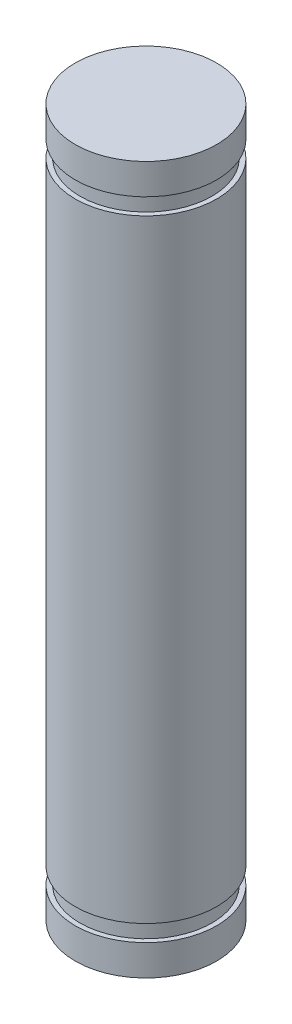
ISO-10303-21;
HEADER;
FILE_DESCRIPTION(('STEP AP214'),'2;1');
FILE_NAME('part.step','',(''),(''),'','','');
FILE_SCHEMA(('AUTOMOTIVE_DESIGN { 1 0 10303 214 1 1 1 1 }'));
ENDSEC;
DATA;
#1=APPLICATION_CONTEXT('core data for automotive mechanical design processes');
#2=APPLICATION_PROTOCOL_DEFINITION('international standard','automotive_design',2000,#1);
#3=PRODUCT_CONTEXT('',#1,'mechanical');
#4=PRODUCT('Part','Part','',(#3));
#5=PRODUCT_RELATED_PRODUCT_CATEGORY('part','',(#4));
#6=PRODUCT_DEFINITION_FORMATION('','',#4);
#7=PRODUCT_DEFINITION_CONTEXT('part definition',#1,'design');
#8=PRODUCT_DEFINITION('design','',#6,#7);
#9=PRODUCT_DEFINITION_SHAPE('','',#8);
#10=(LENGTH_UNIT() NAMED_UNIT(*) SI_UNIT(.MILLI.,.METRE.));
#11=(NAMED_UNIT(*) PLANE_ANGLE_UNIT() SI_UNIT($,.RADIAN.));
#12=(NAMED_UNIT(*) SI_UNIT($,.STERADIAN.) SOLID_ANGLE_UNIT());
#13=UNCERTAINTY_MEASURE_WITH_UNIT(LENGTH_MEASURE(1.E-05),#10,'distance_accuracy_value','');
#14=(GEOMETRIC_REPRESENTATION_CONTEXT(3) GLOBAL_UNCERTAINTY_ASSIGNED_CONTEXT((#13)) GLOBAL_UNIT_ASSIGNED_CONTEXT((#10,
#11,#12)) REPRESENTATION_CONTEXT('',''));
#15=CARTESIAN_POINT('',(0.,0.,0.));
#16=DIRECTION('',(0.,0.,1.));
#17=DIRECTION('',(1.,0.,0.));
#18=AXIS2_PLACEMENT_3D('',#15,#16,#17);
#19=CARTESIAN_POINT('',(0.,15.,0.));
#20=DIRECTION('',(0.,1.,0.));
#21=DIRECTION('',(0.,0.,1.));
#22=AXIS2_PLACEMENT_3D('',#19,#20,#21);
#23=CYLINDRICAL_SURFACE('',#22,3.);
#24=CARTESIAN_POINT('',(0.,-13.7,0.));
#25=DIRECTION('',(0.,1.,0.));
#26=DIRECTION('',(0.,0.,1.));
#27=AXIS2_PLACEMENT_3D('',#24,#25,#26);
#28=CIRCLE('',#27,3.);
#29=CARTESIAN_POINT('',(0.,-13.7,3.));
#30=VERTEX_POINT('',#29);
#31=EDGE_CURVE('E10',#30,#30,#28,.T.);
#32=ORIENTED_EDGE('',*,*,#31,.F.);
#33=EDGE_LOOP('',(#32));
#34=FACE_BOUND('',#33,.T.);
#35=CARTESIAN_POINT('',(0.,-15.,0.));
#36=DIRECTION('',(0.,1.,0.));
#37=DIRECTION('',(0.,0.,1.));
#38=AXIS2_PLACEMENT_3D('',#35,#36,#37);
#39=CIRCLE('',#38,3.);
#40=CARTESIAN_POINT('',(0.,-15.,3.));
#41=VERTEX_POINT('',#40);
#42=EDGE_CURVE('E77',#41,#41,#39,.T.);
#43=ORIENTED_EDGE('',*,*,#42,.T.);
#44=EDGE_LOOP('',(#43));
#45=FACE_BOUND('',#44,.T.);
#46=ADVANCED_FACE('F34',(#34,#45),#23,.T.);
#47=CARTESIAN_POINT('',(3.,-13.7,0.));
#48=DIRECTION('',(0.,-1.,0.));
#49=DIRECTION('',(0.,0.,-1.));
#50=AXIS2_PLACEMENT_3D('',#47,#48,#49);
#51=PLANE('',#50);
#52=CARTESIAN_POINT('',(0.,-13.7,0.));
#53=DIRECTION('',(0.,1.,0.));
#54=DIRECTION('',(0.,0.,1.));
#55=AXIS2_PLACEMENT_3D('',#52,#53,#54);
#56=CIRCLE('',#55,2.8);
#57=CARTESIAN_POINT('',(0.,-13.7,2.8));
#58=VERTEX_POINT('',#57);
#59=EDGE_CURVE('E41',#58,#58,#56,.T.);
#60=ORIENTED_EDGE('',*,*,#59,.F.);
#61=EDGE_LOOP('',(#60));
#62=FACE_BOUND('',#61,.T.);
#63=ORIENTED_EDGE('',*,*,#31,.T.);
#64=EDGE_LOOP('',(#63));
#65=FACE_BOUND('',#64,.T.);
#66=ADVANCED_FACE('F92',(#62,#65),#51,.F.);
#67=CARTESIAN_POINT('',(0.,15.,0.));
#68=DIRECTION('',(0.,1.,0.));
#69=DIRECTION('',(0.,0.,1.));
#70=AXIS2_PLACEMENT_3D('',#67,#68,#69);
#71=CYLINDRICAL_SURFACE('',#70,2.8);
#72=CARTESIAN_POINT('',(0.,-13.,0.));
#73=DIRECTION('',(0.,1.,0.));
#74=DIRECTION('',(0.,0.,1.));
#75=AXIS2_PLACEMENT_3D('',#72,#73,#74);
#76=CIRCLE('',#75,2.8);
#77=CARTESIAN_POINT('',(0.,-13.,2.8));
#78=VERTEX_POINT('',#77);
#79=EDGE_CURVE('E48',#78,#78,#76,.T.);
#80=ORIENTED_EDGE('',*,*,#79,.F.);
#81=EDGE_LOOP('',(#80));
#82=FACE_BOUND('',#81,.T.);
#83=ORIENTED_EDGE('',*,*,#59,.T.);
#84=EDGE_LOOP('',(#83));
#85=FACE_BOUND('',#84,.T.);
#86=ADVANCED_FACE('F97',(#82,#85),#71,.T.);
#87=CARTESIAN_POINT('',(2.8,-13.,0.));
#88=DIRECTION('',(0.,1.,0.));
#89=DIRECTION('',(0.,0.,1.));
#90=AXIS2_PLACEMENT_3D('',#87,#88,#89);
#91=PLANE('',#90);
#92=CARTESIAN_POINT('',(0.,-13.,0.));
#93=DIRECTION('',(0.,1.,0.));
#94=DIRECTION('',(0.,0.,1.));
#95=AXIS2_PLACEMENT_3D('',#92,#93,#94);
#96=CIRCLE('',#95,3.);
#97=CARTESIAN_POINT('',(0.,-13.,3.));
#98=VERTEX_POINT('',#97);
#99=EDGE_CURVE('E52',#98,#98,#96,.T.);
#100=ORIENTED_EDGE('',*,*,#99,.F.);
#101=EDGE_LOOP('',(#100));
#102=FACE_BOUND('',#101,.T.);
#103=ORIENTED_EDGE('',*,*,#79,.T.);
#104=EDGE_LOOP('',(#103));
#105=FACE_BOUND('',#104,.T.);
#106=ADVANCED_FACE('F102',(#102,#105),#91,.F.);
#107=CARTESIAN_POINT('',(0.,15.,0.));
#108=DIRECTION('',(0.,1.,0.));
#109=DIRECTION('',(0.,0.,1.));
#110=AXIS2_PLACEMENT_3D('',#107,#108,#109);
#111=CYLINDRICAL_SURFACE('',#110,3.);
#112=CARTESIAN_POINT('',(0.,13.,0.));
#113=DIRECTION('',(0.,1.,0.));
#114=DIRECTION('',(0.,0.,1.));
#115=AXIS2_PLACEMENT_3D('',#112,#113,#114);
#116=CIRCLE('',#115,3.);
#117=CARTESIAN_POINT('',(0.,13.,3.));
#118=VERTEX_POINT('',#117);
#119=EDGE_CURVE('E57',#118,#118,#116,.T.);
#120=ORIENTED_EDGE('',*,*,#119,.F.);
#121=EDGE_LOOP('',(#120));
#122=FACE_BOUND('',#121,.T.);
#123=ORIENTED_EDGE('',*,*,#99,.T.);
#124=EDGE_LOOP('',(#123));
#125=FACE_BOUND('',#124,.T.);
#126=ADVANCED_FACE('F108',(#122,#125),#111,.T.);
#127=CARTESIAN_POINT('',(3.,13.,0.));
#128=DIRECTION('',(0.,-1.,0.));
#129=DIRECTION('',(0.,0.,-1.));
#130=AXIS2_PLACEMENT_3D('',#127,#128,#129);
#131=PLANE('',#130);
#132=CARTESIAN_POINT('',(0.,13.,0.));
#133=DIRECTION('',(0.,1.,0.));
#134=DIRECTION('',(0.,0.,1.));
#135=AXIS2_PLACEMENT_3D('',#132,#133,#134);
#136=CIRCLE('',#135,2.8);
#137=CARTESIAN_POINT('',(0.,13.,2.8));
#138=VERTEX_POINT('',#137);
#139=EDGE_CURVE('E61',#138,#138,#136,.T.);
#140=ORIENTED_EDGE('',*,*,#139,.F.);
#141=EDGE_LOOP('',(#140));
#142=FACE_BOUND('',#141,.T.);
#143=ORIENTED_EDGE('',*,*,#119,.T.);
#144=EDGE_LOOP('',(#143));
#145=FACE_BOUND('',#144,.T.);
#146=ADVANCED_FACE('F112',(#142,#145),#131,.F.);
#147=CARTESIAN_POINT('',(0.,15.,0.));
#148=DIRECTION('',(0.,1.,0.));
#149=DIRECTION('',(0.,0.,1.));
#150=AXIS2_PLACEMENT_3D('',#147,#148,#149);
#151=CYLINDRICAL_SURFACE('',#150,2.8);
#152=CARTESIAN_POINT('',(0.,13.7,0.));
#153=DIRECTION('',(0.,1.,0.));
#154=DIRECTION('',(0.,0.,1.));
#155=AXIS2_PLACEMENT_3D('',#152,#153,#154);
#156=CIRCLE('',#155,2.8);
#157=CARTESIAN_POINT('',(0.,13.7,2.8));
#158=VERTEX_POINT('',#157);
#159=EDGE_CURVE('E65',#158,#158,#156,.T.);
#160=ORIENTED_EDGE('',*,*,#159,.F.);
#161=EDGE_LOOP('',(#160));
#162=FACE_BOUND('',#161,.T.);
#163=ORIENTED_EDGE('',*,*,#139,.T.);
#164=EDGE_LOOP('',(#163));
#165=FACE_BOUND('',#164,.T.);
#166=ADVANCED_FACE('F116',(#162,#165),#151,.T.);
#167=CARTESIAN_POINT('',(2.8,13.7,0.));
#168=DIRECTION('',(0.,1.,0.));
#169=DIRECTION('',(0.,0.,1.));
#170=AXIS2_PLACEMENT_3D('',#167,#168,#169);
#171=PLANE('',#170);
#172=CARTESIAN_POINT('',(0.,13.7,0.));
#173=DIRECTION('',(0.,1.,0.));
#174=DIRECTION('',(0.,0.,1.));
#175=AXIS2_PLACEMENT_3D('',#172,#173,#174);
#176=CIRCLE('',#175,3.);
#177=CARTESIAN_POINT('',(0.,13.7,3.));
#178=VERTEX_POINT('',#177);
#179=EDGE_CURVE('E69',#178,#178,#176,.T.);
#180=ORIENTED_EDGE('',*,*,#179,.F.);
#181=EDGE_LOOP('',(#180));
#182=FACE_BOUND('',#181,.T.);
#183=ORIENTED_EDGE('',*,*,#159,.T.);
#184=EDGE_LOOP('',(#183));
#185=FACE_BOUND('',#184,.T.);
#186=ADVANCED_FACE('F120',(#182,#185),#171,.F.);
#187=CARTESIAN_POINT('',(0.,15.,0.));
#188=DIRECTION('',(0.,1.,0.));
#189=DIRECTION('',(0.,0.,1.));
#190=AXIS2_PLACEMENT_3D('',#187,#188,#189);
#191=CYLINDRICAL_SURFACE('',#190,3.);
#192=CARTESIAN_POINT('',(0.,15.,0.));
#193=DIRECTION('',(0.,1.,0.));
#194=DIRECTION('',(0.,0.,1.));
#195=AXIS2_PLACEMENT_3D('',#192,#193,#194);
#196=CIRCLE('',#195,3.);
#197=CARTESIAN_POINT('',(0.,15.,3.));
#198=VERTEX_POINT('',#197);
#199=EDGE_CURVE('E73',#198,#198,#196,.T.);
#200=ORIENTED_EDGE('',*,*,#199,.F.);
#201=EDGE_LOOP('',(#200));
#202=FACE_BOUND('',#201,.T.);
#203=ORIENTED_EDGE('',*,*,#179,.T.);
#204=EDGE_LOOP('',(#203));
#205=FACE_BOUND('',#204,.T.);
#206=ADVANCED_FACE('F88',(#202,#205),#191,.T.);
#207=CARTESIAN_POINT('',(3.,15.,0.));
#208=DIRECTION('',(0.,-1.,0.));
#209=DIRECTION('',(0.,0.,-1.));
#210=AXIS2_PLACEMENT_3D('',#207,#208,#209);
#211=PLANE('',#210);
#212=ORIENTED_EDGE('',*,*,#199,.T.);
#213=EDGE_LOOP('',(#212));
#214=FACE_BOUND('',#213,.T.);
#215=ADVANCED_FACE('F84',(#214),#211,.F.);
#216=CARTESIAN_POINT('',(0.,-15.,0.));
#217=DIRECTION('',(0.,1.,0.));
#218=DIRECTION('',(0.,0.,1.));
#219=AXIS2_PLACEMENT_3D('',#216,#217,#218);
#220=PLANE('',#219);
#221=ORIENTED_EDGE('',*,*,#42,.F.);
#222=EDGE_LOOP('',(#221));
#223=FACE_BOUND('',#222,.T.);
#224=ADVANCED_FACE('F82',(#223),#220,.F.);
#225=CLOSED_SHELL('',(#46,#66,#86,#106,#126,#146,#166,#186,#206,#215,#224));
#226=MANIFOLD_SOLID_BREP('B2',#225);
#227=ADVANCED_BREP_SHAPE_REPRESENTATION('',(#18,#226),#14);
#228=SHAPE_DEFINITION_REPRESENTATION(#9,#227);
ENDSEC;
END-ISO-10303-21;
